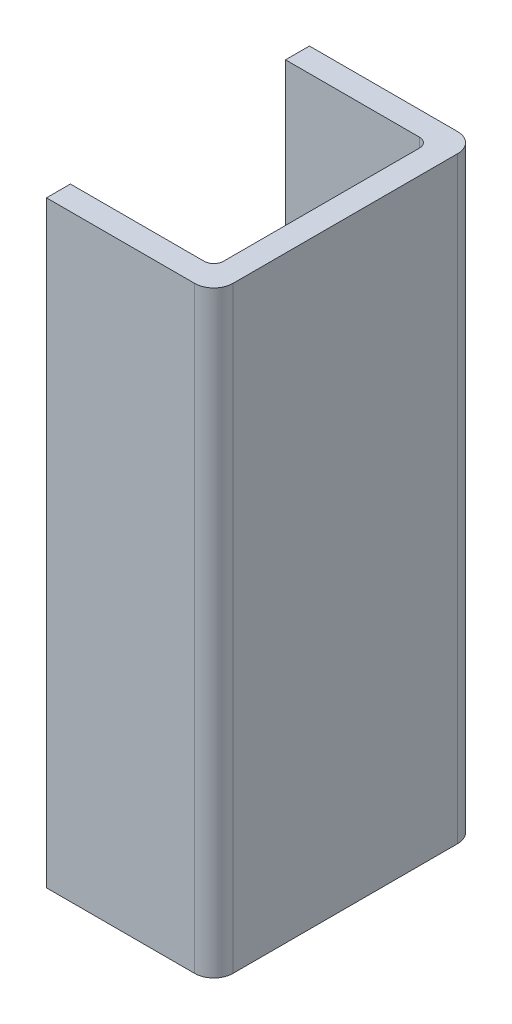
ISO-10303-21;
HEADER;
FILE_DESCRIPTION(('STEP AP214'),'2;1');
FILE_NAME('part.step','',(''),(''),'','','');
FILE_SCHEMA(('AUTOMOTIVE_DESIGN { 1 0 10303 214 1 1 1 1 }'));
ENDSEC;
DATA;
#1=APPLICATION_CONTEXT('core data for automotive mechanical design processes');
#2=APPLICATION_PROTOCOL_DEFINITION('international standard','automotive_design',2000,#1);
#3=PRODUCT_CONTEXT('',#1,'mechanical');
#4=PRODUCT('Part','Part','',(#3));
#5=PRODUCT_RELATED_PRODUCT_CATEGORY('part','',(#4));
#6=PRODUCT_DEFINITION_FORMATION('','',#4);
#7=PRODUCT_DEFINITION_CONTEXT('part definition',#1,'design');
#8=PRODUCT_DEFINITION('design','',#6,#7);
#9=PRODUCT_DEFINITION_SHAPE('','',#8);
#10=(LENGTH_UNIT() NAMED_UNIT(*) SI_UNIT(.MILLI.,.METRE.));
#11=(NAMED_UNIT(*) PLANE_ANGLE_UNIT() SI_UNIT($,.RADIAN.));
#12=(NAMED_UNIT(*) SI_UNIT($,.STERADIAN.) SOLID_ANGLE_UNIT());
#13=UNCERTAINTY_MEASURE_WITH_UNIT(LENGTH_MEASURE(1.E-05),#10,'distance_accuracy_value','');
#14=(GEOMETRIC_REPRESENTATION_CONTEXT(3) GLOBAL_UNCERTAINTY_ASSIGNED_CONTEXT((#13)) GLOBAL_UNIT_ASSIGNED_CONTEXT((#10,
#11,#12)) REPRESENTATION_CONTEXT('',''));
#15=CARTESIAN_POINT('',(0.,0.,0.));
#16=DIRECTION('',(0.,0.,1.));
#17=DIRECTION('',(1.,0.,0.));
#18=AXIS2_PLACEMENT_3D('',#15,#16,#17);
#19=CARTESIAN_POINT('',(0.93,-0.625,0.07));
#20=DIRECTION('',(0.,1.,0.));
#21=DIRECTION('',(0.707106781186548,0.,-0.707106781186547));
#22=AXIS2_PLACEMENT_3D('',#19,#20,#21);
#23=CYLINDRICAL_SURFACE('',#22,0.02);
#24=CARTESIAN_POINT('',(0.93,-0.625,0.07));
#25=DIRECTION('',(0.,-1.,0.));
#26=DIRECTION('',(0.,0.,-1.));
#27=AXIS2_PLACEMENT_3D('',#24,#25,#26);
#28=CIRCLE('',#27,0.02);
#29=CARTESIAN_POINT('',(0.93,-0.625,0.05));
#30=VERTEX_POINT('',#29);
#31=CARTESIAN_POINT('',(0.95,-0.625,0.07));
#32=VERTEX_POINT('',#31);
#33=EDGE_CURVE('E11',#30,#32,#28,.T.);
#34=ORIENTED_EDGE('',*,*,#33,.T.);
#35=DIRECTION('',(0.,1.,0.));
#36=VECTOR('',#35,1.);
#37=CARTESIAN_POINT('',(0.95,-0.625,0.07));
#38=LINE('',#37,#36);
#39=CARTESIAN_POINT('',(0.95,0.625,0.07));
#40=VERTEX_POINT('',#39);
#41=EDGE_CURVE('E24',#32,#40,#38,.T.);
#42=ORIENTED_EDGE('',*,*,#41,.T.);
#43=CARTESIAN_POINT('',(0.93,0.625,0.07));
#44=DIRECTION('',(0.,1.,0.));
#45=DIRECTION('',(1.,0.,0.));
#46=AXIS2_PLACEMENT_3D('',#43,#44,#45);
#47=CIRCLE('',#46,0.02);
#48=CARTESIAN_POINT('',(0.93,0.625,0.05));
#49=VERTEX_POINT('',#48);
#50=EDGE_CURVE('E191',#40,#49,#47,.T.);
#51=ORIENTED_EDGE('',*,*,#50,.T.);
#52=DIRECTION('',(0.,-1.,0.));
#53=VECTOR('',#52,1.);
#54=CARTESIAN_POINT('',(0.93,0.625,0.05));
#55=LINE('',#54,#53);
#56=EDGE_CURVE('E184',#49,#30,#55,.T.);
#57=ORIENTED_EDGE('',*,*,#56,.T.);
#58=EDGE_LOOP('',(#34,#42,#51,#57));
#59=FACE_BOUND('',#58,.T.);
#60=ADVANCED_FACE('F17',(#59),#23,.F.);
#61=CARTESIAN_POINT('',(0.95,-0.625,0.));
#62=DIRECTION('',(-1.,0.,0.));
#63=DIRECTION('',(0.,0.,1.));
#64=AXIS2_PLACEMENT_3D('',#61,#62,#63);
#65=PLANE('',#64);
#66=ORIENTED_EDGE('',*,*,#41,.F.);
#67=DIRECTION('',(0.,0.,1.));
#68=VECTOR('',#67,1.);
#69=CARTESIAN_POINT('',(0.95,-0.625,0.07));
#70=LINE('',#69,#68);
#71=CARTESIAN_POINT('',(0.95,-0.625,0.48));
#72=VERTEX_POINT('',#71);
#73=EDGE_CURVE('E193',#32,#72,#70,.T.);
#74=ORIENTED_EDGE('',*,*,#73,.T.);
#75=DIRECTION('',(0.,-1.,0.));
#76=VECTOR('',#75,1.);
#77=CARTESIAN_POINT('',(0.95,0.625,0.48));
#78=LINE('',#77,#76);
#79=CARTESIAN_POINT('',(0.95,0.625,0.48));
#80=VERTEX_POINT('',#79);
#81=EDGE_CURVE('E186',#80,#72,#78,.T.);
#82=ORIENTED_EDGE('',*,*,#81,.F.);
#83=DIRECTION('',(0.,0.,-1.));
#84=VECTOR('',#83,1.);
#85=CARTESIAN_POINT('',(0.95,0.625,0.48));
#86=LINE('',#85,#84);
#87=EDGE_CURVE('E178',#80,#40,#86,.T.);
#88=ORIENTED_EDGE('',*,*,#87,.T.);
#89=EDGE_LOOP('',(#66,#74,#82,#88));
#90=FACE_BOUND('',#89,.T.);
#91=ADVANCED_FACE('F206',(#90),#65,.T.);
#92=CARTESIAN_POINT('',(0.93,-0.625,0.48));
#93=DIRECTION('',(0.,-1.,0.));
#94=DIRECTION('',(0.707106781186548,0.,0.707106781186548));
#95=AXIS2_PLACEMENT_3D('',#92,#93,#94);
#96=CYLINDRICAL_SURFACE('',#95,0.02);
#97=CARTESIAN_POINT('',(0.93,0.625,0.48));
#98=DIRECTION('',(0.,1.,0.));
#99=DIRECTION('',(0.,0.,1.));
#100=AXIS2_PLACEMENT_3D('',#97,#98,#99);
#101=CIRCLE('',#100,0.02);
#102=CARTESIAN_POINT('',(0.93,0.625,0.5));
#103=VERTEX_POINT('',#102);
#104=EDGE_CURVE('E195',#103,#80,#101,.T.);
#105=ORIENTED_EDGE('',*,*,#104,.T.);
#106=ORIENTED_EDGE('',*,*,#81,.T.);
#107=CARTESIAN_POINT('',(0.93,-0.625,0.48));
#108=DIRECTION('',(0.,-1.,0.));
#109=DIRECTION('',(1.,0.,0.));
#110=AXIS2_PLACEMENT_3D('',#107,#108,#109);
#111=CIRCLE('',#110,0.02);
#112=CARTESIAN_POINT('',(0.93,-0.625,0.5));
#113=VERTEX_POINT('',#112);
#114=EDGE_CURVE('E180',#72,#113,#111,.T.);
#115=ORIENTED_EDGE('',*,*,#114,.T.);
#116=DIRECTION('',(0.,1.,0.));
#117=VECTOR('',#116,1.);
#118=CARTESIAN_POINT('',(0.93,-0.625,0.5));
#119=LINE('',#118,#117);
#120=EDGE_CURVE('E172',#113,#103,#119,.T.);
#121=ORIENTED_EDGE('',*,*,#120,.T.);
#122=EDGE_LOOP('',(#105,#106,#115,#121));
#123=FACE_BOUND('',#122,.T.);
#124=ADVANCED_FACE('F199',(#123),#96,.F.);
#125=CARTESIAN_POINT('',(0.96,-0.3125,0.04));
#126=DIRECTION('',(0.,1.,0.));
#127=DIRECTION('',(0.707106781186548,0.,-0.707106781186547));
#128=AXIS2_PLACEMENT_3D('',#125,#126,#127);
#129=CYLINDRICAL_SURFACE('',#128,0.04);
#130=CARTESIAN_POINT('',(0.96,0.625,0.04));
#131=DIRECTION('',(0.,-1.,0.));
#132=DIRECTION('',(0.,0.,-1.));
#133=AXIS2_PLACEMENT_3D('',#130,#131,#132);
#134=CIRCLE('',#133,0.04);
#135=CARTESIAN_POINT('',(0.96,0.625,0.));
#136=VERTEX_POINT('',#135);
#137=CARTESIAN_POINT('',(1.,0.625,0.04));
#138=VERTEX_POINT('',#137);
#139=EDGE_CURVE('E189',#136,#138,#134,.T.);
#140=ORIENTED_EDGE('',*,*,#139,.T.);
#141=DIRECTION('',(0.,-1.,0.));
#142=VECTOR('',#141,1.);
#143=CARTESIAN_POINT('',(1.,0.625,0.04));
#144=LINE('',#143,#142);
#145=CARTESIAN_POINT('',(1.,-0.625,0.04));
#146=VERTEX_POINT('',#145);
#147=EDGE_CURVE('E182',#138,#146,#144,.T.);
#148=ORIENTED_EDGE('',*,*,#147,.T.);
#149=CARTESIAN_POINT('',(0.96,-0.625,0.04));
#150=DIRECTION('',(0.,1.,0.));
#151=DIRECTION('',(1.,0.,0.));
#152=AXIS2_PLACEMENT_3D('',#149,#150,#151);
#153=CIRCLE('',#152,0.04);
#154=CARTESIAN_POINT('',(0.96,-0.625,0.));
#155=VERTEX_POINT('',#154);
#156=EDGE_CURVE('E174',#146,#155,#153,.T.);
#157=ORIENTED_EDGE('',*,*,#156,.T.);
#158=DIRECTION('',(0.,1.,0.));
#159=VECTOR('',#158,1.);
#160=CARTESIAN_POINT('',(0.96,-0.625,0.));
#161=LINE('',#160,#159);
#162=EDGE_CURVE('E162',#155,#136,#161,.T.);
#163=ORIENTED_EDGE('',*,*,#162,.T.);
#164=EDGE_LOOP('',(#140,#148,#157,#163));
#165=FACE_BOUND('',#164,.T.);
#166=ADVANCED_FACE('F227',(#165),#129,.T.);
#167=CARTESIAN_POINT('',(1.,-0.625,0.));
#168=DIRECTION('',(1.,0.,0.));
#169=DIRECTION('',(0.,1.,0.));
#170=AXIS2_PLACEMENT_3D('',#167,#168,#169);
#171=PLANE('',#170);
#172=ORIENTED_EDGE('',*,*,#147,.F.);
#173=DIRECTION('',(0.,0.,1.));
#174=VECTOR('',#173,1.);
#175=CARTESIAN_POINT('',(1.,0.625,0.04));
#176=LINE('',#175,#174);
#177=CARTESIAN_POINT('',(1.,0.625,0.51));
#178=VERTEX_POINT('',#177);
#179=EDGE_CURVE('E176',#138,#178,#176,.T.);
#180=ORIENTED_EDGE('',*,*,#179,.T.);
#181=DIRECTION('',(0.,1.,0.));
#182=VECTOR('',#181,1.);
#183=CARTESIAN_POINT('',(1.,-0.625,0.51));
#184=LINE('',#183,#182);
#185=CARTESIAN_POINT('',(1.,-0.625,0.51));
#186=VERTEX_POINT('',#185);
#187=EDGE_CURVE('E165',#186,#178,#184,.T.);
#188=ORIENTED_EDGE('',*,*,#187,.F.);
#189=DIRECTION('',(0.,0.,1.));
#190=VECTOR('',#189,1.);
#191=CARTESIAN_POINT('',(1.,-0.625,0.04));
#192=LINE('',#191,#190);
#193=EDGE_CURVE('E155',#146,#186,#192,.T.);
#194=ORIENTED_EDGE('',*,*,#193,.F.);
#195=EDGE_LOOP('',(#172,#180,#188,#194));
#196=FACE_BOUND('',#195,.T.);
#197=ADVANCED_FACE('F225',(#196),#171,.T.);
#198=CARTESIAN_POINT('',(1.,0.625,0.));
#199=DIRECTION('',(0.,1.,0.));
#200=DIRECTION('',(-1.,0.,0.));
#201=AXIS2_PLACEMENT_3D('',#198,#199,#200);
#202=PLANE('',#201);
#203=ORIENTED_EDGE('',*,*,#139,.F.);
#204=DIRECTION('',(-1.,0.,0.));
#205=VECTOR('',#204,1.);
#206=CARTESIAN_POINT('',(0.96,0.625,0.));
#207=LINE('',#206,#205);
#208=CARTESIAN_POINT('',(0.65,0.625,0.));
#209=VERTEX_POINT('',#208);
#210=EDGE_CURVE('E168',#136,#209,#207,.T.);
#211=ORIENTED_EDGE('',*,*,#210,.T.);
#212=DIRECTION('',(0.,0.,-1.));
#213=VECTOR('',#212,1.);
#214=CARTESIAN_POINT('',(0.65,0.625,0.05));
#215=LINE('',#214,#213);
#216=CARTESIAN_POINT('',(0.65,0.625,0.05));
#217=VERTEX_POINT('',#216);
#218=EDGE_CURVE('E157',#217,#209,#215,.T.);
#219=ORIENTED_EDGE('',*,*,#218,.F.);
#220=DIRECTION('',(-1.,0.,0.));
#221=VECTOR('',#220,1.);
#222=CARTESIAN_POINT('',(0.93,0.625,0.05));
#223=LINE('',#222,#221);
#224=EDGE_CURVE('E152',#49,#217,#223,.T.);
#225=ORIENTED_EDGE('',*,*,#224,.F.);
#226=ORIENTED_EDGE('',*,*,#50,.F.);
#227=ORIENTED_EDGE('',*,*,#87,.F.);
#228=ORIENTED_EDGE('',*,*,#104,.F.);
#229=DIRECTION('',(1.,0.,0.));
#230=VECTOR('',#229,1.);
#231=CARTESIAN_POINT('',(0.65,0.625,0.5));
#232=LINE('',#231,#230);
#233=CARTESIAN_POINT('',(0.65,0.625,0.5));
#234=VERTEX_POINT('',#233);
#235=EDGE_CURVE('E112',#234,#103,#232,.T.);
#236=ORIENTED_EDGE('',*,*,#235,.F.);
#237=DIRECTION('',(0.,0.,-1.));
#238=VECTOR('',#237,1.);
#239=CARTESIAN_POINT('',(0.65,0.625,0.55));
#240=LINE('',#239,#238);
#241=CARTESIAN_POINT('',(0.65,0.625,0.55));
#242=VERTEX_POINT('',#241);
#243=EDGE_CURVE('E144',#242,#234,#240,.T.);
#244=ORIENTED_EDGE('',*,*,#243,.F.);
#245=DIRECTION('',(-1.,0.,0.));
#246=VECTOR('',#245,1.);
#247=CARTESIAN_POINT('',(0.96,0.625,0.55));
#248=LINE('',#247,#246);
#249=CARTESIAN_POINT('',(0.96,0.625,0.55));
#250=VERTEX_POINT('',#249);
#251=EDGE_CURVE('E111',#250,#242,#248,.T.);
#252=ORIENTED_EDGE('',*,*,#251,.F.);
#253=CARTESIAN_POINT('',(0.96,0.625,0.51));
#254=DIRECTION('',(0.,-1.,0.));
#255=DIRECTION('',(1.,0.,0.));
#256=AXIS2_PLACEMENT_3D('',#253,#254,#255);
#257=CIRCLE('',#256,0.04);
#258=EDGE_CURVE('E170',#178,#250,#257,.T.);
#259=ORIENTED_EDGE('',*,*,#258,.F.);
#260=ORIENTED_EDGE('',*,*,#179,.F.);
#261=EDGE_LOOP('',(#203,#211,#219,#225,#226,#227,#228,#236,#244,#252,#259,#260));
#262=FACE_BOUND('',#261,.T.);
#263=ADVANCED_FACE('F209',(#262),#202,.T.);
#264=CARTESIAN_POINT('',(0.96,-0.625,0.51));
#265=DIRECTION('',(0.,1.,0.));
#266=DIRECTION('',(0.707106781186548,0.,0.707106781186548));
#267=AXIS2_PLACEMENT_3D('',#264,#265,#266);
#268=CYLINDRICAL_SURFACE('',#267,0.04);
#269=ORIENTED_EDGE('',*,*,#258,.T.);
#270=DIRECTION('',(0.,-1.,0.));
#271=VECTOR('',#270,1.);
#272=CARTESIAN_POINT('',(0.96,0.625,0.55));
#273=LINE('',#272,#271);
#274=CARTESIAN_POINT('',(0.96,-0.625,0.55));
#275=VERTEX_POINT('',#274);
#276=EDGE_CURVE('E160',#250,#275,#273,.T.);
#277=ORIENTED_EDGE('',*,*,#276,.T.);
#278=CARTESIAN_POINT('',(0.96,-0.625,0.51));
#279=DIRECTION('',(0.,1.,0.));
#280=DIRECTION('',(0.,0.,1.));
#281=AXIS2_PLACEMENT_3D('',#278,#279,#280);
#282=CIRCLE('',#281,0.04);
#283=EDGE_CURVE('E127',#275,#186,#282,.T.);
#284=ORIENTED_EDGE('',*,*,#283,.T.);
#285=ORIENTED_EDGE('',*,*,#187,.T.);
#286=EDGE_LOOP('',(#269,#277,#284,#285));
#287=FACE_BOUND('',#286,.T.);
#288=ADVANCED_FACE('F221',(#287),#268,.T.);
#289=CARTESIAN_POINT('',(0.65,-0.625,0.05));
#290=DIRECTION('',(0.,0.,1.));
#291=DIRECTION('',(1.,0.,0.));
#292=AXIS2_PLACEMENT_3D('',#289,#290,#291);
#293=PLANE('',#292);
#294=ORIENTED_EDGE('',*,*,#56,.F.);
#295=ORIENTED_EDGE('',*,*,#224,.T.);
#296=DIRECTION('',(0.,1.,0.));
#297=VECTOR('',#296,1.);
#298=CARTESIAN_POINT('',(0.65,-0.625,0.05));
#299=LINE('',#298,#297);
#300=CARTESIAN_POINT('',(0.65,-0.625,0.05));
#301=VERTEX_POINT('',#300);
#302=EDGE_CURVE('E146',#301,#217,#299,.T.);
#303=ORIENTED_EDGE('',*,*,#302,.F.);
#304=DIRECTION('',(1.,0.,0.));
#305=VECTOR('',#304,1.);
#306=CARTESIAN_POINT('',(0.65,-0.625,0.05));
#307=LINE('',#306,#305);
#308=EDGE_CURVE('E136',#301,#30,#307,.T.);
#309=ORIENTED_EDGE('',*,*,#308,.T.);
#310=EDGE_LOOP('',(#294,#295,#303,#309));
#311=FACE_BOUND('',#310,.T.);
#312=ADVANCED_FACE('F213',(#311),#293,.T.);
#313=CARTESIAN_POINT('',(0.65,-0.625,0.));
#314=DIRECTION('',(-1.,0.,0.));
#315=DIRECTION('',(0.,0.,1.));
#316=AXIS2_PLACEMENT_3D('',#313,#314,#315);
#317=PLANE('',#316);
#318=ORIENTED_EDGE('',*,*,#218,.T.);
#319=DIRECTION('',(0.,-1.,0.));
#320=VECTOR('',#319,1.);
#321=CARTESIAN_POINT('',(0.65,0.625,0.));
#322=LINE('',#321,#320);
#323=CARTESIAN_POINT('',(0.65,-0.625,0.));
#324=VERTEX_POINT('',#323);
#325=EDGE_CURVE('E149',#209,#324,#322,.T.);
#326=ORIENTED_EDGE('',*,*,#325,.T.);
#327=DIRECTION('',(0.,0.,1.));
#328=VECTOR('',#327,1.);
#329=CARTESIAN_POINT('',(0.65,-0.625,0.));
#330=LINE('',#329,#328);
#331=EDGE_CURVE('E139',#324,#301,#330,.T.);
#332=ORIENTED_EDGE('',*,*,#331,.T.);
#333=ORIENTED_EDGE('',*,*,#302,.T.);
#334=EDGE_LOOP('',(#318,#326,#332,#333));
#335=FACE_BOUND('',#334,.T.);
#336=ADVANCED_FACE('F233',(#335),#317,.T.);
#337=CARTESIAN_POINT('',(1.,-0.625,0.5));
#338=DIRECTION('',(0.,0.,-1.));
#339=DIRECTION('',(-1.,0.,0.));
#340=AXIS2_PLACEMENT_3D('',#337,#338,#339);
#341=PLANE('',#340);
#342=ORIENTED_EDGE('',*,*,#120,.F.);
#343=DIRECTION('',(-1.,0.,0.));
#344=VECTOR('',#343,1.);
#345=CARTESIAN_POINT('',(0.93,-0.625,0.5));
#346=LINE('',#345,#344);
#347=CARTESIAN_POINT('',(0.65,-0.625,0.5));
#348=VERTEX_POINT('',#347);
#349=EDGE_CURVE('E142',#113,#348,#346,.T.);
#350=ORIENTED_EDGE('',*,*,#349,.T.);
#351=DIRECTION('',(0.,1.,0.));
#352=VECTOR('',#351,1.);
#353=CARTESIAN_POINT('',(0.65,-0.625,0.5));
#354=LINE('',#353,#352);
#355=EDGE_CURVE('E107',#348,#234,#354,.T.);
#356=ORIENTED_EDGE('',*,*,#355,.T.);
#357=ORIENTED_EDGE('',*,*,#235,.T.);
#358=EDGE_LOOP('',(#342,#350,#356,#357));
#359=FACE_BOUND('',#358,.T.);
#360=ADVANCED_FACE('F217',(#359),#341,.T.);
#361=CARTESIAN_POINT('',(0.65,-0.625,0.5));
#362=DIRECTION('',(-1.,0.,0.));
#363=DIRECTION('',(0.,0.,1.));
#364=AXIS2_PLACEMENT_3D('',#361,#362,#363);
#365=PLANE('',#364);
#366=ORIENTED_EDGE('',*,*,#243,.T.);
#367=ORIENTED_EDGE('',*,*,#355,.F.);
#368=DIRECTION('',(0.,0.,1.));
#369=VECTOR('',#368,1.);
#370=CARTESIAN_POINT('',(0.65,-0.625,0.5));
#371=LINE('',#370,#369);
#372=CARTESIAN_POINT('',(0.65,-0.625,0.55));
#373=VERTEX_POINT('',#372);
#374=EDGE_CURVE('E101',#348,#373,#371,.T.);
#375=ORIENTED_EDGE('',*,*,#374,.T.);
#376=DIRECTION('',(0.,1.,0.));
#377=VECTOR('',#376,1.);
#378=CARTESIAN_POINT('',(0.65,-0.625,0.55));
#379=LINE('',#378,#377);
#380=EDGE_CURVE('E104',#373,#242,#379,.T.);
#381=ORIENTED_EDGE('',*,*,#380,.T.);
#382=EDGE_LOOP('',(#366,#367,#375,#381));
#383=FACE_BOUND('',#382,.T.);
#384=ADVANCED_FACE('F103',(#383),#365,.T.);
#385=CARTESIAN_POINT('',(0.65,-0.625,0.55));
#386=DIRECTION('',(0.,0.,1.));
#387=DIRECTION('',(1.,0.,0.));
#388=AXIS2_PLACEMENT_3D('',#385,#386,#387);
#389=PLANE('',#388);
#390=ORIENTED_EDGE('',*,*,#276,.F.);
#391=ORIENTED_EDGE('',*,*,#251,.T.);
#392=ORIENTED_EDGE('',*,*,#380,.F.);
#393=DIRECTION('',(1.,0.,0.));
#394=VECTOR('',#393,1.);
#395=CARTESIAN_POINT('',(0.65,-0.625,0.55));
#396=LINE('',#395,#394);
#397=EDGE_CURVE('E118',#373,#275,#396,.T.);
#398=ORIENTED_EDGE('',*,*,#397,.T.);
#399=EDGE_LOOP('',(#390,#391,#392,#398));
#400=FACE_BOUND('',#399,.T.);
#401=ADVANCED_FACE('F117',(#400),#389,.T.);
#402=CARTESIAN_POINT('',(-1.,-0.625,0.));
#403=DIRECTION('',(0.,-1.,0.));
#404=DIRECTION('',(1.,0.,0.));
#405=AXIS2_PLACEMENT_3D('',#402,#403,#404);
#406=PLANE('',#405);
#407=ORIENTED_EDGE('',*,*,#156,.F.);
#408=ORIENTED_EDGE('',*,*,#193,.T.);
#409=ORIENTED_EDGE('',*,*,#283,.F.);
#410=ORIENTED_EDGE('',*,*,#397,.F.);
#411=ORIENTED_EDGE('',*,*,#374,.F.);
#412=ORIENTED_EDGE('',*,*,#349,.F.);
#413=ORIENTED_EDGE('',*,*,#114,.F.);
#414=ORIENTED_EDGE('',*,*,#73,.F.);
#415=ORIENTED_EDGE('',*,*,#33,.F.);
#416=ORIENTED_EDGE('',*,*,#308,.F.);
#417=ORIENTED_EDGE('',*,*,#331,.F.);
#418=DIRECTION('',(1.,0.,0.));
#419=VECTOR('',#418,1.);
#420=CARTESIAN_POINT('',(0.65,-0.625,0.));
#421=LINE('',#420,#419);
#422=EDGE_CURVE('E120',#324,#155,#421,.T.);
#423=ORIENTED_EDGE('',*,*,#422,.T.);
#424=EDGE_LOOP('',(#407,#408,#409,#410,#411,#412,#413,#414,#415,#416,#417,#423));
#425=FACE_BOUND('',#424,.T.);
#426=ADVANCED_FACE('F124',(#425),#406,.T.);
#427=CARTESIAN_POINT('',(0.,0.,0.));
#428=DIRECTION('',(0.,0.,1.));
#429=DIRECTION('',(1.,0.,0.));
#430=AXIS2_PLACEMENT_3D('',#427,#428,#429);
#431=PLANE('',#430);
#432=ORIENTED_EDGE('',*,*,#162,.F.);
#433=ORIENTED_EDGE('',*,*,#422,.F.);
#434=ORIENTED_EDGE('',*,*,#325,.F.);
#435=ORIENTED_EDGE('',*,*,#210,.F.);
#436=EDGE_LOOP('',(#432,#433,#434,#435));
#437=FACE_BOUND('',#436,.T.);
#438=ADVANCED_FACE('F235',(#437),#431,.F.);
#439=CLOSED_SHELL('',(#60,#91,#124,#166,#197,#263,#288,#312,#336,#360,#384,#401,#426,#438));
#440=MANIFOLD_SOLID_BREP('B1',#439);
#441=ADVANCED_BREP_SHAPE_REPRESENTATION('',(#18,#440),#14);
#442=SHAPE_DEFINITION_REPRESENTATION(#9,#441);
ENDSEC;
END-ISO-10303-21;
